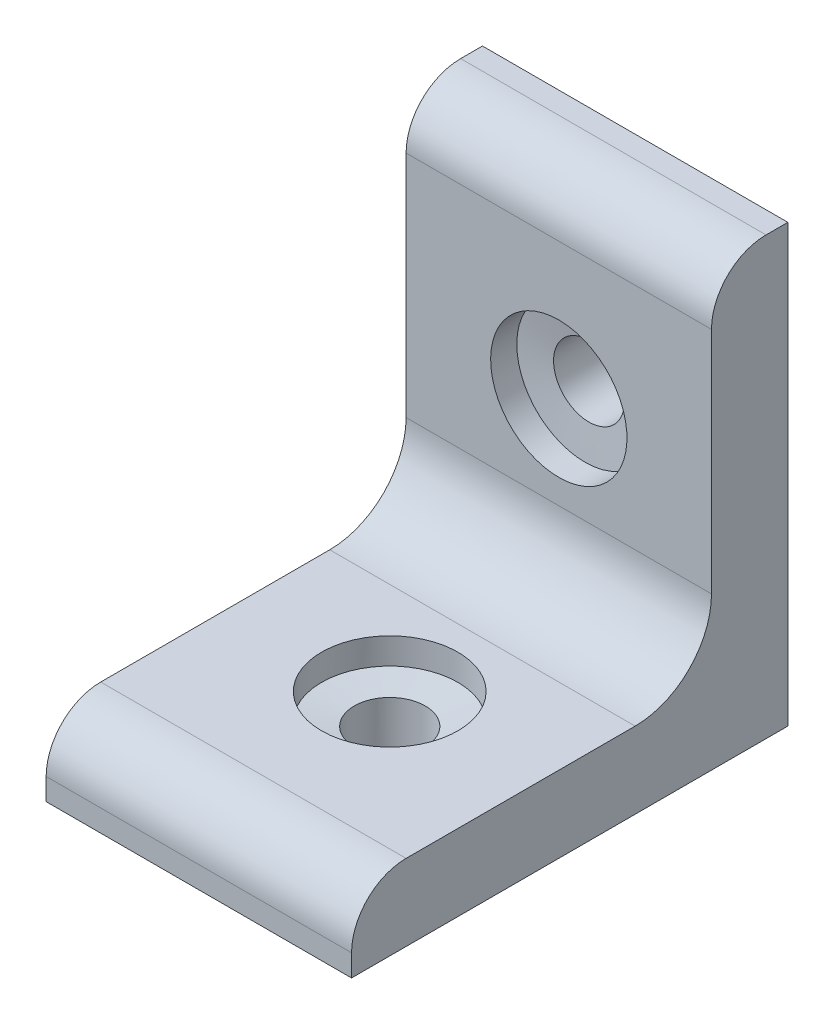
ISO-10303-21;
HEADER;
FILE_DESCRIPTION(('STEP AP214'),'2;1');
FILE_NAME('part.step','',(''),(''),'','','');
FILE_SCHEMA(('AUTOMOTIVE_DESIGN { 1 0 10303 214 1 1 1 1 }'));
ENDSEC;
DATA;
#1=APPLICATION_CONTEXT('core data for automotive mechanical design processes');
#2=APPLICATION_PROTOCOL_DEFINITION('international standard','automotive_design',2000,#1);
#3=PRODUCT_CONTEXT('',#1,'mechanical');
#4=PRODUCT('Part','Part','',(#3));
#5=PRODUCT_RELATED_PRODUCT_CATEGORY('part','',(#4));
#6=PRODUCT_DEFINITION_FORMATION('','',#4);
#7=PRODUCT_DEFINITION_CONTEXT('part definition',#1,'design');
#8=PRODUCT_DEFINITION('design','',#6,#7);
#9=PRODUCT_DEFINITION_SHAPE('','',#8);
#10=(LENGTH_UNIT() NAMED_UNIT(*) SI_UNIT(.MILLI.,.METRE.));
#11=(NAMED_UNIT(*) PLANE_ANGLE_UNIT() SI_UNIT($,.RADIAN.));
#12=(NAMED_UNIT(*) SI_UNIT($,.STERADIAN.) SOLID_ANGLE_UNIT());
#13=UNCERTAINTY_MEASURE_WITH_UNIT(LENGTH_MEASURE(1.E-05),#10,'distance_accuracy_value','');
#14=(GEOMETRIC_REPRESENTATION_CONTEXT(3) GLOBAL_UNCERTAINTY_ASSIGNED_CONTEXT((#13)) GLOBAL_UNIT_ASSIGNED_CONTEXT((#10,
#11,#12)) REPRESENTATION_CONTEXT('',''));
#15=CARTESIAN_POINT('',(0.,0.,0.));
#16=DIRECTION('',(0.,0.,1.));
#17=DIRECTION('',(1.,0.,0.));
#18=AXIS2_PLACEMENT_3D('',#15,#16,#17);
#19=CARTESIAN_POINT('',(14.,22.5,40.001));
#20=DIRECTION('',(0.,0.,-1.));
#21=DIRECTION('',(0.,1.,0.));
#22=AXIS2_PLACEMENT_3D('',#19,#20,#21);
#23=CYLINDRICAL_SURFACE('',#22,3.25);
#24=CARTESIAN_POINT('',(14.,22.5,4.23001195358669));
#25=DIRECTION('',(0.,0.,1.));
#26=DIRECTION('',(0.,-1.,0.));
#27=AXIS2_PLACEMENT_3D('',#24,#25,#26);
#28=CIRCLE('',#27,3.25);
#29=CARTESIAN_POINT('',(11.0555687792613,23.8757996897583,4.2300119535867));
#30=VERTEX_POINT('',#29);
#31=EDGE_CURVE('E262',#30,#30,#28,.F.);
#32=ORIENTED_EDGE('',*,*,#31,.F.);
#33=EDGE_LOOP('',(#32));
#34=FACE_BOUND('',#33,.T.);
#35=CARTESIAN_POINT('',(14.,22.5,0.));
#36=DIRECTION('',(0.,0.,1.));
#37=DIRECTION('',(0.,-1.,0.));
#38=AXIS2_PLACEMENT_3D('',#35,#36,#37);
#39=CIRCLE('',#38,3.25);
#40=CARTESIAN_POINT('',(14.,19.25,0.));
#41=VERTEX_POINT('',#40);
#42=EDGE_CURVE('E261',#41,#41,#39,.T.);
#43=ORIENTED_EDGE('',*,*,#42,.F.);
#44=EDGE_LOOP('',(#43));
#45=FACE_BOUND('',#44,.T.);
#46=ADVANCED_FACE('F16',(#34,#45),#23,.F.);
#47=CARTESIAN_POINT('',(14.,40.001,22.5));
#48=DIRECTION('',(0.,-1.,0.));
#49=DIRECTION('',(0.,0.,-1.));
#50=AXIS2_PLACEMENT_3D('',#47,#48,#49);
#51=CYLINDRICAL_SURFACE('',#50,3.25);
#52=CARTESIAN_POINT('',(14.,0.,22.5));
#53=DIRECTION('',(0.,-1.,0.));
#54=DIRECTION('',(0.,0.,-1.));
#55=AXIS2_PLACEMENT_3D('',#52,#53,#54);
#56=CIRCLE('',#55,3.25);
#57=CARTESIAN_POINT('',(14.,0.,19.25));
#58=VERTEX_POINT('',#57);
#59=EDGE_CURVE('E125',#58,#58,#56,.T.);
#60=ORIENTED_EDGE('',*,*,#59,.T.);
#61=EDGE_LOOP('',(#60));
#62=FACE_BOUND('',#61,.T.);
#63=CARTESIAN_POINT('',(14.,4.23001195358669,22.5));
#64=DIRECTION('',(0.,-1.,0.));
#65=DIRECTION('',(0.,0.,-1.));
#66=AXIS2_PLACEMENT_3D('',#63,#64,#65);
#67=CIRCLE('',#66,3.25);
#68=CARTESIAN_POINT('',(11.0555687792613,4.23001195358669,23.8757996897583));
#69=VERTEX_POINT('',#68);
#70=EDGE_CURVE('E236',#69,#69,#67,.F.);
#71=ORIENTED_EDGE('',*,*,#70,.T.);
#72=EDGE_LOOP('',(#71));
#73=FACE_BOUND('',#72,.T.);
#74=ADVANCED_FACE('F182',(#62,#73),#51,.F.);
#75=CARTESIAN_POINT('',(28.,7.,0.));
#76=DIRECTION('',(0.,-1.,0.));
#77=DIRECTION('',(0.,0.,-1.));
#78=AXIS2_PLACEMENT_3D('',#75,#76,#77);
#79=PLANE('',#78);
#80=CARTESIAN_POINT('',(14.,7.,22.5));
#81=DIRECTION('',(0.,1.,0.));
#82=DIRECTION('',(0.,0.,1.));
#83=AXIS2_PLACEMENT_3D('',#80,#81,#82);
#84=CIRCLE('',#83,6.25);
#85=CARTESIAN_POINT('',(14.,7.,28.75));
#86=VERTEX_POINT('',#85);
#87=EDGE_CURVE('E234',#86,#86,#84,.T.);
#88=ORIENTED_EDGE('',*,*,#87,.F.);
#89=EDGE_LOOP('',(#88));
#90=FACE_BOUND('',#89,.T.);
#91=DIRECTION('',(0.,0.,1.));
#92=VECTOR('',#91,1.);
#93=CARTESIAN_POINT('',(28.,7.,0.));
#94=LINE('',#93,#92);
#95=CARTESIAN_POINT('',(28.,7.,14.));
#96=VERTEX_POINT('',#95);
#97=CARTESIAN_POINT('',(28.,7.,35.));
#98=VERTEX_POINT('',#97);
#99=EDGE_CURVE('E110',#96,#98,#94,.T.);
#100=ORIENTED_EDGE('',*,*,#99,.F.);
#101=DIRECTION('',(-1.,0.,0.));
#102=VECTOR('',#101,1.);
#103=CARTESIAN_POINT('',(0.,7.,14.));
#104=LINE('',#103,#102);
#105=CARTESIAN_POINT('',(0.,7.,14.));
#106=VERTEX_POINT('',#105);
#107=EDGE_CURVE('E156',#96,#106,#104,.T.);
#108=ORIENTED_EDGE('',*,*,#107,.T.);
#109=DIRECTION('',(0.,0.,1.));
#110=VECTOR('',#109,1.);
#111=CARTESIAN_POINT('',(0.,7.,0.));
#112=LINE('',#111,#110);
#113=CARTESIAN_POINT('',(0.,7.,35.));
#114=VERTEX_POINT('',#113);
#115=EDGE_CURVE('E123',#106,#114,#112,.T.);
#116=ORIENTED_EDGE('',*,*,#115,.T.);
#117=DIRECTION('',(-1.,0.,0.));
#118=VECTOR('',#117,1.);
#119=CARTESIAN_POINT('',(28.,7.,35.));
#120=LINE('',#119,#118);
#121=EDGE_CURVE('E145',#114,#98,#120,.F.);
#122=ORIENTED_EDGE('',*,*,#121,.T.);
#123=EDGE_LOOP('',(#100,#108,#116,#122));
#124=FACE_BOUND('',#123,.T.);
#125=ADVANCED_FACE('F162',(#90,#124),#79,.F.);
#126=CARTESIAN_POINT('',(28.,0.,40.));
#127=DIRECTION('',(0.,0.,1.));
#128=DIRECTION('',(1.,0.,0.));
#129=AXIS2_PLACEMENT_3D('',#126,#127,#128);
#130=PLANE('',#129);
#131=DIRECTION('',(0.,1.,0.));
#132=VECTOR('',#131,1.);
#133=CARTESIAN_POINT('',(28.,0.,40.));
#134=LINE('',#133,#132);
#135=CARTESIAN_POINT('',(28.,0.,40.));
#136=VERTEX_POINT('',#135);
#137=CARTESIAN_POINT('',(28.,2.,40.));
#138=VERTEX_POINT('',#137);
#139=EDGE_CURVE('E91',#136,#138,#134,.T.);
#140=ORIENTED_EDGE('',*,*,#139,.T.);
#141=DIRECTION('',(-1.,0.,0.));
#142=VECTOR('',#141,1.);
#143=CARTESIAN_POINT('',(0.,2.,40.));
#144=LINE('',#143,#142);
#145=CARTESIAN_POINT('',(0.,2.,40.));
#146=VERTEX_POINT('',#145);
#147=EDGE_CURVE('E99',#138,#146,#144,.T.);
#148=ORIENTED_EDGE('',*,*,#147,.T.);
#149=DIRECTION('',(0.,1.,0.));
#150=VECTOR('',#149,1.);
#151=CARTESIAN_POINT('',(0.,0.,40.));
#152=LINE('',#151,#150);
#153=CARTESIAN_POINT('',(0.,0.,40.));
#154=VERTEX_POINT('',#153);
#155=EDGE_CURVE('E94',#154,#146,#152,.T.);
#156=ORIENTED_EDGE('',*,*,#155,.F.);
#157=DIRECTION('',(-1.,0.,0.));
#158=VECTOR('',#157,1.);
#159=CARTESIAN_POINT('',(28.,0.,40.));
#160=LINE('',#159,#158);
#161=EDGE_CURVE('E87',#136,#154,#160,.T.);
#162=ORIENTED_EDGE('',*,*,#161,.F.);
#163=EDGE_LOOP('',(#140,#148,#156,#162));
#164=FACE_BOUND('',#163,.T.);
#165=ADVANCED_FACE('F89',(#164),#130,.T.);
#166=CARTESIAN_POINT('',(28.,0.,0.));
#167=DIRECTION('',(0.,-1.,0.));
#168=DIRECTION('',(0.,0.,-1.));
#169=AXIS2_PLACEMENT_3D('',#166,#167,#168);
#170=PLANE('',#169);
#171=ORIENTED_EDGE('',*,*,#59,.F.);
#172=EDGE_LOOP('',(#171));
#173=FACE_BOUND('',#172,.T.);
#174=DIRECTION('',(0.,0.,1.));
#175=VECTOR('',#174,1.);
#176=CARTESIAN_POINT('',(0.,0.,0.));
#177=LINE('',#176,#175);
#178=CARTESIAN_POINT('',(0.,0.,0.));
#179=VERTEX_POINT('',#178);
#180=EDGE_CURVE('E127',#179,#154,#177,.T.);
#181=ORIENTED_EDGE('',*,*,#180,.F.);
#182=DIRECTION('',(-1.,0.,0.));
#183=VECTOR('',#182,1.);
#184=CARTESIAN_POINT('',(28.,0.,0.));
#185=LINE('',#184,#183);
#186=CARTESIAN_POINT('',(28.,0.,0.));
#187=VERTEX_POINT('',#186);
#188=EDGE_CURVE('E100',#187,#179,#185,.T.);
#189=ORIENTED_EDGE('',*,*,#188,.F.);
#190=DIRECTION('',(0.,0.,1.));
#191=VECTOR('',#190,1.);
#192=CARTESIAN_POINT('',(28.,0.,0.));
#193=LINE('',#192,#191);
#194=EDGE_CURVE('E106',#187,#136,#193,.T.);
#195=ORIENTED_EDGE('',*,*,#194,.T.);
#196=ORIENTED_EDGE('',*,*,#161,.T.);
#197=EDGE_LOOP('',(#181,#189,#195,#196));
#198=FACE_BOUND('',#197,.T.);
#199=ADVANCED_FACE('F112',(#173,#198),#170,.T.);
#200=CARTESIAN_POINT('',(28.,0.,0.));
#201=DIRECTION('',(0.,0.,-1.));
#202=DIRECTION('',(-1.,0.,0.));
#203=AXIS2_PLACEMENT_3D('',#200,#201,#202);
#204=PLANE('',#203);
#205=ORIENTED_EDGE('',*,*,#42,.T.);
#206=EDGE_LOOP('',(#205));
#207=FACE_BOUND('',#206,.T.);
#208=DIRECTION('',(0.,-1.,0.));
#209=VECTOR('',#208,1.);
#210=CARTESIAN_POINT('',(0.,0.,0.));
#211=LINE('',#210,#209);
#212=CARTESIAN_POINT('',(0.,40.,0.));
#213=VERTEX_POINT('',#212);
#214=EDGE_CURVE('E129',#213,#179,#211,.T.);
#215=ORIENTED_EDGE('',*,*,#214,.F.);
#216=DIRECTION('',(-1.,0.,0.));
#217=VECTOR('',#216,1.);
#218=CARTESIAN_POINT('',(28.,40.,0.));
#219=LINE('',#218,#217);
#220=CARTESIAN_POINT('',(28.,40.,0.));
#221=VERTEX_POINT('',#220);
#222=EDGE_CURVE('E122',#221,#213,#219,.T.);
#223=ORIENTED_EDGE('',*,*,#222,.F.);
#224=DIRECTION('',(0.,-1.,0.));
#225=VECTOR('',#224,1.);
#226=CARTESIAN_POINT('',(28.,0.,0.));
#227=LINE('',#226,#225);
#228=EDGE_CURVE('E113',#221,#187,#227,.T.);
#229=ORIENTED_EDGE('',*,*,#228,.T.);
#230=ORIENTED_EDGE('',*,*,#188,.T.);
#231=EDGE_LOOP('',(#215,#223,#229,#230));
#232=FACE_BOUND('',#231,.T.);
#233=ADVANCED_FACE('F219',(#207,#232),#204,.T.);
#234=CARTESIAN_POINT('',(28.,40.,7.));
#235=DIRECTION('',(0.,1.,0.));
#236=DIRECTION('',(0.,0.,1.));
#237=AXIS2_PLACEMENT_3D('',#234,#235,#236);
#238=PLANE('',#237);
#239=DIRECTION('',(0.,0.,-1.));
#240=VECTOR('',#239,1.);
#241=CARTESIAN_POINT('',(0.,40.,7.));
#242=LINE('',#241,#240);
#243=CARTESIAN_POINT('',(0.,40.,2.));
#244=VERTEX_POINT('',#243);
#245=EDGE_CURVE('E132',#244,#213,#242,.T.);
#246=ORIENTED_EDGE('',*,*,#245,.F.);
#247=DIRECTION('',(-1.,0.,0.));
#248=VECTOR('',#247,1.);
#249=CARTESIAN_POINT('',(28.,40.,2.));
#250=LINE('',#249,#248);
#251=CARTESIAN_POINT('',(28.,40.,2.));
#252=VERTEX_POINT('',#251);
#253=EDGE_CURVE('E154',#244,#252,#250,.F.);
#254=ORIENTED_EDGE('',*,*,#253,.T.);
#255=DIRECTION('',(0.,0.,-1.));
#256=VECTOR('',#255,1.);
#257=CARTESIAN_POINT('',(28.,40.,7.));
#258=LINE('',#257,#256);
#259=EDGE_CURVE('E115',#252,#221,#258,.T.);
#260=ORIENTED_EDGE('',*,*,#259,.T.);
#261=ORIENTED_EDGE('',*,*,#222,.T.);
#262=EDGE_LOOP('',(#246,#254,#260,#261));
#263=FACE_BOUND('',#262,.T.);
#264=ADVANCED_FACE('F215',(#263),#238,.T.);
#265=CARTESIAN_POINT('',(28.,0.,7.));
#266=DIRECTION('',(0.,0.,-1.));
#267=DIRECTION('',(-1.,0.,0.));
#268=AXIS2_PLACEMENT_3D('',#265,#266,#267);
#269=PLANE('',#268);
#270=CARTESIAN_POINT('',(14.,22.5,7.));
#271=DIRECTION('',(0.,0.,-1.));
#272=DIRECTION('',(0.,1.,0.));
#273=AXIS2_PLACEMENT_3D('',#270,#271,#272);
#274=CIRCLE('',#273,6.25);
#275=CARTESIAN_POINT('',(14.,28.75,7.));
#276=VERTEX_POINT('',#275);
#277=EDGE_CURVE('E260',#276,#276,#274,.T.);
#278=ORIENTED_EDGE('',*,*,#277,.T.);
#279=EDGE_LOOP('',(#278));
#280=FACE_BOUND('',#279,.T.);
#281=DIRECTION('',(0.,1.,0.));
#282=VECTOR('',#281,1.);
#283=CARTESIAN_POINT('',(0.,0.,7.));
#284=LINE('',#283,#282);
#285=CARTESIAN_POINT('',(0.,35.,7.));
#286=VERTEX_POINT('',#285);
#287=CARTESIAN_POINT('',(0.,14.,7.));
#288=VERTEX_POINT('',#287);
#289=EDGE_CURVE('E134',#286,#288,#284,.F.);
#290=ORIENTED_EDGE('',*,*,#289,.T.);
#291=DIRECTION('',(-1.,0.,0.));
#292=VECTOR('',#291,1.);
#293=CARTESIAN_POINT('',(28.,14.,7.));
#294=LINE('',#293,#292);
#295=CARTESIAN_POINT('',(28.,14.,7.));
#296=VERTEX_POINT('',#295);
#297=EDGE_CURVE('E37',#288,#296,#294,.F.);
#298=ORIENTED_EDGE('',*,*,#297,.T.);
#299=DIRECTION('',(0.,1.,0.));
#300=VECTOR('',#299,1.);
#301=CARTESIAN_POINT('',(28.,0.,7.));
#302=LINE('',#301,#300);
#303=CARTESIAN_POINT('',(28.,35.,7.));
#304=VERTEX_POINT('',#303);
#305=EDGE_CURVE('E120',#304,#296,#302,.F.);
#306=ORIENTED_EDGE('',*,*,#305,.F.);
#307=DIRECTION('',(-1.,0.,0.));
#308=VECTOR('',#307,1.);
#309=CARTESIAN_POINT('',(0.,35.,7.));
#310=LINE('',#309,#308);
#311=EDGE_CURVE('E151',#304,#286,#310,.T.);
#312=ORIENTED_EDGE('',*,*,#311,.T.);
#313=EDGE_LOOP('',(#290,#298,#306,#312));
#314=FACE_BOUND('',#313,.T.);
#315=ADVANCED_FACE('F211',(#280,#314),#269,.F.);
#316=CARTESIAN_POINT('',(28.,0.,0.));
#317=DIRECTION('',(-1.,0.,0.));
#318=DIRECTION('',(0.,0.,1.));
#319=AXIS2_PLACEMENT_3D('',#316,#317,#318);
#320=PLANE('',#319);
#321=ORIENTED_EDGE('',*,*,#305,.T.);
#322=CARTESIAN_POINT('',(28.,14.,14.));
#323=DIRECTION('',(-1.,0.,0.));
#324=DIRECTION('',(0.,0.,1.));
#325=AXIS2_PLACEMENT_3D('',#322,#323,#324);
#326=CIRCLE('',#325,7.);
#327=EDGE_CURVE('E10',#296,#96,#326,.T.);
#328=ORIENTED_EDGE('',*,*,#327,.T.);
#329=ORIENTED_EDGE('',*,*,#99,.T.);
#330=CARTESIAN_POINT('',(28.,2.,35.));
#331=DIRECTION('',(-1.,0.,0.));
#332=DIRECTION('',(0.,0.,1.));
#333=AXIS2_PLACEMENT_3D('',#330,#331,#332);
#334=CIRCLE('',#333,5.);
#335=EDGE_CURVE('E109',#98,#138,#334,.F.);
#336=ORIENTED_EDGE('',*,*,#335,.T.);
#337=ORIENTED_EDGE('',*,*,#139,.F.);
#338=ORIENTED_EDGE('',*,*,#194,.F.);
#339=ORIENTED_EDGE('',*,*,#228,.F.);
#340=ORIENTED_EDGE('',*,*,#259,.F.);
#341=CARTESIAN_POINT('',(28.,35.,2.));
#342=DIRECTION('',(-1.,0.,0.));
#343=DIRECTION('',(0.,0.,1.));
#344=AXIS2_PLACEMENT_3D('',#341,#342,#343);
#345=CIRCLE('',#344,5.);
#346=EDGE_CURVE('E148',#252,#304,#345,.F.);
#347=ORIENTED_EDGE('',*,*,#346,.T.);
#348=EDGE_LOOP('',(#321,#328,#329,#336,#337,#338,#339,#340,#347));
#349=FACE_BOUND('',#348,.T.);
#350=ADVANCED_FACE('F104',(#349),#320,.F.);
#351=CARTESIAN_POINT('',(0.,0.,0.));
#352=DIRECTION('',(-1.,0.,0.));
#353=DIRECTION('',(0.,0.,1.));
#354=AXIS2_PLACEMENT_3D('',#351,#352,#353);
#355=PLANE('',#354);
#356=ORIENTED_EDGE('',*,*,#155,.T.);
#357=CARTESIAN_POINT('',(0.,2.,35.));
#358=DIRECTION('',(-1.,0.,0.));
#359=DIRECTION('',(0.,0.,1.));
#360=AXIS2_PLACEMENT_3D('',#357,#358,#359);
#361=CIRCLE('',#360,5.);
#362=EDGE_CURVE('E142',#146,#114,#361,.T.);
#363=ORIENTED_EDGE('',*,*,#362,.T.);
#364=ORIENTED_EDGE('',*,*,#115,.F.);
#365=CARTESIAN_POINT('',(0.,14.,14.));
#366=DIRECTION('',(-1.,0.,0.));
#367=DIRECTION('',(0.,0.,1.));
#368=AXIS2_PLACEMENT_3D('',#365,#366,#367);
#369=CIRCLE('',#368,7.);
#370=EDGE_CURVE('E24',#106,#288,#369,.F.);
#371=ORIENTED_EDGE('',*,*,#370,.T.);
#372=ORIENTED_EDGE('',*,*,#289,.F.);
#373=CARTESIAN_POINT('',(0.,35.,2.));
#374=DIRECTION('',(-1.,0.,0.));
#375=DIRECTION('',(0.,0.,1.));
#376=AXIS2_PLACEMENT_3D('',#373,#374,#375);
#377=CIRCLE('',#376,5.);
#378=EDGE_CURVE('E140',#286,#244,#377,.T.);
#379=ORIENTED_EDGE('',*,*,#378,.T.);
#380=ORIENTED_EDGE('',*,*,#245,.T.);
#381=ORIENTED_EDGE('',*,*,#214,.T.);
#382=ORIENTED_EDGE('',*,*,#180,.T.);
#383=EDGE_LOOP('',(#356,#363,#364,#371,#372,#379,#380,#381,#382));
#384=FACE_BOUND('',#383,.T.);
#385=ADVANCED_FACE('F165',(#384),#355,.T.);
#386=CARTESIAN_POINT('',(28.,2.,35.));
#387=DIRECTION('',(1.,0.,0.));
#388=DIRECTION('',(0.,0.,-1.));
#389=AXIS2_PLACEMENT_3D('',#386,#387,#388);
#390=CYLINDRICAL_SURFACE('',#389,5.);
#391=ORIENTED_EDGE('',*,*,#335,.F.);
#392=ORIENTED_EDGE('',*,*,#121,.F.);
#393=ORIENTED_EDGE('',*,*,#362,.F.);
#394=ORIENTED_EDGE('',*,*,#147,.F.);
#395=EDGE_LOOP('',(#391,#392,#393,#394));
#396=FACE_BOUND('',#395,.T.);
#397=ADVANCED_FACE('F168',(#396),#390,.T.);
#398=CARTESIAN_POINT('',(28.,35.,2.));
#399=DIRECTION('',(1.,0.,0.));
#400=DIRECTION('',(0.,0.,-1.));
#401=AXIS2_PLACEMENT_3D('',#398,#399,#400);
#402=CYLINDRICAL_SURFACE('',#401,5.);
#403=ORIENTED_EDGE('',*,*,#346,.F.);
#404=ORIENTED_EDGE('',*,*,#253,.F.);
#405=ORIENTED_EDGE('',*,*,#378,.F.);
#406=ORIENTED_EDGE('',*,*,#311,.F.);
#407=EDGE_LOOP('',(#403,#404,#405,#406));
#408=FACE_BOUND('',#407,.T.);
#409=ADVANCED_FACE('F170',(#408),#402,.T.);
#410=CARTESIAN_POINT('',(14.,4.6,22.5));
#411=DIRECTION('',(0.,1.,0.));
#412=DIRECTION('',(0.,0.,1.));
#413=AXIS2_PLACEMENT_3D('',#410,#411,#412);
#414=CYLINDRICAL_SURFACE('',#413,6.25);
#415=CARTESIAN_POINT('',(14.,4.6,22.5));
#416=DIRECTION('',(0.,1.,0.));
#417=DIRECTION('',(0.,0.,1.));
#418=AXIS2_PLACEMENT_3D('',#415,#416,#417);
#419=CIRCLE('',#418,6.25);
#420=CARTESIAN_POINT('',(7.97153486855651,4.6,24.1492750404253));
#421=VERTEX_POINT('',#420);
#422=EDGE_CURVE('E241',#421,#421,#419,.T.);
#423=ORIENTED_EDGE('',*,*,#422,.F.);
#424=EDGE_LOOP('',(#423));
#425=FACE_BOUND('',#424,.T.);
#426=ORIENTED_EDGE('',*,*,#87,.T.);
#427=EDGE_LOOP('',(#426));
#428=FACE_BOUND('',#427,.T.);
#429=ADVANCED_FACE('F177',(#425,#428),#414,.F.);
#430=CARTESIAN_POINT('',(7.97153486855651,4.6,24.1492750404253));
#431=CARTESIAN_POINT('',(17.140580557091,3.5,23.3362139465604));
#432=CARTESIAN_POINT('',(4.67298478770585,4.6,12.0923447775383));
#433=CARTESIAN_POINT('',(15.4681526639701,3.5,29.6173750607424));
#434=CARTESIAN_POINT('',(16.7299150505928,4.6,8.79379469668768));
#435=CARTESIAN_POINT('',(9.18699154978817,3.5,27.9449471676215));
#436=CARTESIAN_POINT('',(20.0284651314435,4.6,20.8507249595747));
#437=CARTESIAN_POINT('',(10.859419442909,3.5,21.6637860534396));
#438=CARTESIAN_POINT('',(23.3270152122941,4.6,32.9076552224617));
#439=CARTESIAN_POINT('',(12.5318473360299,3.5,15.3826249392576));
#440=CARTESIAN_POINT('',(11.2700849494072,4.6,36.2062053033123));
#441=CARTESIAN_POINT('',(18.8130084502118,3.5,17.0550528323785));
#442=CARTESIAN_POINT('',(7.97153486855651,4.6,24.1492750404253));
#443=CARTESIAN_POINT('',(17.140580557091,3.5,23.3362139465604));
#444=(BOUNDED_SURFACE() B_SPLINE_SURFACE(3,1,((#430,#431),(#432,#433),(#434,#435),(#436,#437),
(#438,#439),(#440,#441),(#442,#443)),.UNSPECIFIED.,.T.,.F.,.F.) B_SPLINE_SURFACE_WITH_KNOTS((4,
3,4),(2,2),(0.,0.5,1.),(0.,1.),
.UNSPECIFIED.) GEOMETRIC_REPRESENTATION_ITEM() RATIONAL_B_SPLINE_SURFACE(((1.,1.),
(0.333333333333333,0.333333333333333),(0.333333333333333,0.333333333333333),(1.,1.),
(0.333333333333333,0.333333333333333),(0.333333333333333,0.333333333333333),(1.,1.))) REPRESENTATION_ITEM('') SURFACE());
#445=CARTESIAN_POINT('',(7.97153486855651,4.6,24.1492750404253));
#446=CARTESIAN_POINT('',(8.00366022179301,4.59614595784986,24.1464263388559));
#447=CARTESIAN_POINT('',(8.03578557502952,4.59229191569972,24.1435776372864));
#448=CARTESIAN_POINT('',(8.10003628150254,4.58458383139944,24.1378802341475));
#449=CARTESIAN_POINT('',(8.13216163473905,4.5807297892493,24.1350315325781));
#450=CARTESIAN_POINT('',(8.19641234121206,4.57302170494903,24.1293341294392));
#451=CARTESIAN_POINT('',(8.22853769444857,4.56916766279889,24.1264854278697));
#452=CARTESIAN_POINT('',(8.29278840092159,4.56145957849861,24.1207880247308));
#453=CARTESIAN_POINT('',(8.32491375415809,4.55760553634847,24.1179393231614));
#454=CARTESIAN_POINT('',(8.38916446063111,4.5498974520482,24.1122419200225));
#455=CARTESIAN_POINT('',(8.42128981386762,4.54604340989806,24.109393218453));
#456=CARTESIAN_POINT('',(8.48554052034063,4.53833532559778,24.1036958153141));
#457=CARTESIAN_POINT('',(8.51766587357714,4.53448128344764,24.1008471137447));
#458=CARTESIAN_POINT('',(8.58191658005016,4.52677319914736,24.0951497106058));
#459=CARTESIAN_POINT('',(8.61404193328666,4.52291915699723,24.0923010090364));
#460=CARTESIAN_POINT('',(8.67829263975968,4.51521107269695,24.0866036058975));
#461=CARTESIAN_POINT('',(8.71041799299619,4.51135703054681,24.083754904328));
#462=CARTESIAN_POINT('',(8.77466869946921,4.50364894624653,24.0780575011891));
#463=CARTESIAN_POINT('',(8.80679405270571,4.49979490409639,24.0752087996197));
#464=CARTESIAN_POINT('',(8.87104475917873,4.49208681979612,24.0695113964808));
#465=CARTESIAN_POINT('',(8.90317011241524,4.48823277764598,24.0666626949113));
#466=CARTESIAN_POINT('',(8.96742081888825,4.4805246933457,24.0609652917724));
#467=CARTESIAN_POINT('',(8.99954617212476,4.47667065119556,24.058116590203));
#468=CARTESIAN_POINT('',(9.06379687859778,4.46896256689528,24.0524191870641));
#469=CARTESIAN_POINT('',(9.09592223183428,4.46510852474515,24.0495704854946));
#470=CARTESIAN_POINT('',(9.1601729383073,4.45740044044487,24.0438730823557));
#471=CARTESIAN_POINT('',(9.19229829154381,4.45354639829473,24.0410243807863));
#472=CARTESIAN_POINT('',(9.25654899801682,4.44583831399445,24.0353269776474));
#473=CARTESIAN_POINT('',(9.28867435125333,4.44198427184431,24.0324782760779));
#474=CARTESIAN_POINT('',(9.35292505772635,4.43427618754404,24.026780872939));
#475=CARTESIAN_POINT('',(9.38505041096286,4.4304221453939,24.0239321713696));
#476=CARTESIAN_POINT('',(9.44930111743587,4.42271406109362,24.0182347682307));
#477=CARTESIAN_POINT('',(9.48142647067238,4.41886001894348,24.0153860666613));
#478=CARTESIAN_POINT('',(9.5456771771454,4.4111519346432,24.0096886635224));
#479=CARTESIAN_POINT('',(9.5778025303819,4.40729789249307,24.0068399619529));
#480=CARTESIAN_POINT('',(9.64205323685492,4.39958980819279,24.001142558814));
#481=CARTESIAN_POINT('',(9.67417859009143,4.39573576604265,23.9982938572446));
#482=CARTESIAN_POINT('',(9.73842929656444,4.38802768174237,23.9925964541057));
#483=CARTESIAN_POINT('',(9.77055464980095,4.38417363959223,23.9897477525362));
#484=CARTESIAN_POINT('',(9.83480535627397,4.37646555529196,23.9840503493973));
#485=CARTESIAN_POINT('',(9.86693070951048,4.37261151314182,23.9812016478279));
#486=CARTESIAN_POINT('',(9.93118141598349,4.36490342884154,23.975504244689));
#487=CARTESIAN_POINT('',(9.96330676922,4.3610493866914,23.9726555431195));
#488=CARTESIAN_POINT('',(10.027557475693,4.35334130239112,23.9669581399806));
#489=CARTESIAN_POINT('',(10.0596828289295,4.34948726024099,23.9641094384112));
#490=CARTESIAN_POINT('',(10.1239335354025,4.34177917594071,23.9584120352723));
#491=CARTESIAN_POINT('',(10.156058888639,4.33792513379057,23.9555633337028));
#492=CARTESIAN_POINT('',(10.2203095951121,4.33021704949029,23.9498659305639));
#493=CARTESIAN_POINT('',(10.2524349483486,4.32636300734015,23.9470172289945));
#494=CARTESIAN_POINT('',(10.3166856548216,4.31865492303988,23.9413198258556));
#495=CARTESIAN_POINT('',(10.3488110080581,4.31480088088974,23.9384711242861));
#496=CARTESIAN_POINT('',(10.4130617145311,4.30709279658946,23.9327737211472));
#497=CARTESIAN_POINT('',(10.4451870677676,4.30323875443932,23.9299250195778));
#498=CARTESIAN_POINT('',(10.5094377742406,4.29553067013905,23.9242276164389));
#499=CARTESIAN_POINT('',(10.5415631274771,4.29167662798891,23.9213789148695));
#500=CARTESIAN_POINT('',(10.6058138339502,4.28396854368863,23.9156815117306));
#501=CARTESIAN_POINT('',(10.6379391871867,4.28011450153849,23.9128328101611));
#502=CARTESIAN_POINT('',(10.7021898936597,4.27240641723821,23.9071354070222));
#503=CARTESIAN_POINT('',(10.7343152468962,4.26855237508807,23.9042867054528));
#504=CARTESIAN_POINT('',(10.7985659533692,4.2608442907878,23.8985893023139));
#505=CARTESIAN_POINT('',(10.8306913066057,4.25699024863766,23.8957406007444));
#506=CARTESIAN_POINT('',(10.8949420130787,4.24928216433738,23.8900431976055));
#507=CARTESIAN_POINT('',(10.9270673663152,4.24542812218724,23.8871944960361));
#508=CARTESIAN_POINT('',(10.9913180727883,4.23772003788697,23.8814970928972));
#509=CARTESIAN_POINT('',(11.0234434260248,4.23386599573683,23.8786483913277));
#510=CARTESIAN_POINT('',(11.0555687792613,4.23001195358669,23.8757996897583));
#511=B_SPLINE_CURVE_WITH_KNOTS('',3,(#445,#446,#447,#448,#449,#450,#451,#452,#453,#454,#455,
#456,#457,#458,#459,#460,#461,#462,#463,#464,#465,#466,#467,#468,#469,#470,#471,#472,#473,#474,
#475,#476,#477,#478,#479,#480,#481,#482,#483,#484,#485,#486,#487,#488,#489,#490,#491,#492,#493,
#494,#495,#496,#497,#498,#499,#500,#501,#502,#503,#504,#505,#506,#507,#508,#509,#510),
.UNSPECIFIED.,.F.,.F.,(4,2,2,2,2,2,2,2,2,2,2,2,2,2,2,2,2,2,2,2,2,2,2,2,2,2,2,2,2,2,2,2,4),(0.,
0.0974426167489111,0.194885233497822,0.292327850246733,0.389770466995643,0.487213083744554,
0.584655700493465,0.682098317242376,0.779540933991288,0.876983550740199,0.974426167489108,
1.07186878423802,1.16931140098693,1.26675401773584,1.36419663448475,1.46163925123366,
1.55908186798257,1.65652448473148,1.7539671014804,1.85140971822931,1.94885233497822,
2.04629495172713,2.14373756847604,2.24118018522495,2.33862280197386,2.43606541872277,
2.53350803547168,2.63095065222059,2.7283932689695,2.82583588571842,2.92327850246733,
3.02072111921624,3.11816373596515),.UNSPECIFIED.);
#512=EDGE_CURVE('',#421,#69,#511,.T.);
#513=ORIENTED_EDGE('',*,*,#422,.T.);
#514=ORIENTED_EDGE('',*,*,#70,.F.);
#515=ORIENTED_EDGE('',*,*,#512,.T.);
#516=ORIENTED_EDGE('',*,*,#512,.F.);
#517=EDGE_LOOP('',(#513,#515,#514,#516));
#518=FACE_BOUND('',#517,.T.);
#519=ADVANCED_FACE('F196',(#518),#444,.F.);
#520=CARTESIAN_POINT('',(28.,14.,14.));
#521=DIRECTION('',(1.,0.,0.));
#522=DIRECTION('',(0.,0.,-1.));
#523=AXIS2_PLACEMENT_3D('',#520,#521,#522);
#524=CYLINDRICAL_SURFACE('',#523,7.);
#525=ORIENTED_EDGE('',*,*,#327,.F.);
#526=ORIENTED_EDGE('',*,*,#297,.F.);
#527=ORIENTED_EDGE('',*,*,#370,.F.);
#528=ORIENTED_EDGE('',*,*,#107,.F.);
#529=EDGE_LOOP('',(#525,#526,#527,#528));
#530=FACE_BOUND('',#529,.T.);
#531=ADVANCED_FACE('F18',(#530),#524,.F.);
#532=CARTESIAN_POINT('',(14.,22.5,4.6));
#533=DIRECTION('',(0.,0.,1.));
#534=DIRECTION('',(0.,-1.,0.));
#535=AXIS2_PLACEMENT_3D('',#532,#533,#534);
#536=CYLINDRICAL_SURFACE('',#535,6.25);
#537=CARTESIAN_POINT('',(14.,22.5,4.6));
#538=DIRECTION('',(0.,0.,-1.));
#539=DIRECTION('',(0.,1.,0.));
#540=AXIS2_PLACEMENT_3D('',#537,#538,#539);
#541=CIRCLE('',#540,6.25);
#542=CARTESIAN_POINT('',(7.97153486855651,24.1492750404253,4.6));
#543=VERTEX_POINT('',#542);
#544=EDGE_CURVE('E257',#543,#543,#541,.T.);
#545=ORIENTED_EDGE('',*,*,#544,.T.);
#546=EDGE_LOOP('',(#545));
#547=FACE_BOUND('',#546,.T.);
#548=ORIENTED_EDGE('',*,*,#277,.F.);
#549=EDGE_LOOP('',(#548));
#550=FACE_BOUND('',#549,.T.);
#551=ADVANCED_FACE('F194',(#547,#550),#536,.F.);
#552=CARTESIAN_POINT('',(7.97153486855651,24.1492750404253,4.6));
#553=CARTESIAN_POINT('',(17.140580557091,23.3362139465604,3.5));
#554=CARTESIAN_POINT('',(4.67298478770585,12.0923447775383,4.6));
#555=CARTESIAN_POINT('',(15.4681526639701,29.6173750607424,3.5));
#556=CARTESIAN_POINT('',(16.7299150505928,8.79379469668768,4.6));
#557=CARTESIAN_POINT('',(9.18699154978817,27.9449471676215,3.5));
#558=CARTESIAN_POINT('',(20.0284651314435,20.8507249595747,4.6));
#559=CARTESIAN_POINT('',(10.859419442909,21.6637860534396,3.5));
#560=CARTESIAN_POINT('',(23.3270152122941,32.9076552224617,4.6));
#561=CARTESIAN_POINT('',(12.5318473360299,15.3826249392576,3.5));
#562=CARTESIAN_POINT('',(11.2700849494072,36.2062053033123,4.6));
#563=CARTESIAN_POINT('',(18.8130084502118,17.0550528323785,3.5));
#564=CARTESIAN_POINT('',(7.97153486855651,24.1492750404253,4.6));
#565=CARTESIAN_POINT('',(17.140580557091,23.3362139465604,3.5));
#566=(BOUNDED_SURFACE() B_SPLINE_SURFACE(3,1,((#552,#553),(#554,#555),(#556,#557),(#558,#559),
(#560,#561),(#562,#563),(#564,#565)),.UNSPECIFIED.,.T.,.F.,.F.) B_SPLINE_SURFACE_WITH_KNOTS((4,
3,4),(2,2),(0.,0.5,1.),(0.,1.),
.UNSPECIFIED.) GEOMETRIC_REPRESENTATION_ITEM() RATIONAL_B_SPLINE_SURFACE(((1.,1.),
(0.333333333333333,0.333333333333333),(0.333333333333333,0.333333333333333),(1.,1.),
(0.333333333333333,0.333333333333333),(0.333333333333333,0.333333333333333),(1.,1.))) REPRESENTATION_ITEM('') SURFACE());
#567=CARTESIAN_POINT('',(11.0555687792613,23.8757996897583,4.2300119535867));
#568=CARTESIAN_POINT('',(11.0234434260248,23.8786483913277,4.23386599573683));
#569=CARTESIAN_POINT('',(10.9913180727882,23.8814970928972,4.23772003788697));
#570=CARTESIAN_POINT('',(10.9270673663152,23.8871944960361,4.24542812218725));
#571=CARTESIAN_POINT('',(10.8949420130787,23.8900431976055,4.24928216433739));
#572=CARTESIAN_POINT('',(10.8306913066057,23.8957406007444,4.25699024863767));
#573=CARTESIAN_POINT('',(10.7985659533692,23.8985893023139,4.26084429078781));
#574=CARTESIAN_POINT('',(10.7343152468962,23.9042867054528,4.26855237508808));
#575=CARTESIAN_POINT('',(10.7021898936597,23.9071354070222,4.27240641723822));
#576=CARTESIAN_POINT('',(10.6379391871867,23.9128328101611,4.2801145015385));
#577=CARTESIAN_POINT('',(10.6058138339502,23.9156815117306,4.28396854368864));
#578=CARTESIAN_POINT('',(10.5415631274771,23.9213789148695,4.29167662798891));
#579=CARTESIAN_POINT('',(10.5094377742406,23.9242276164389,4.29553067013905));
#580=CARTESIAN_POINT('',(10.4451870677676,23.9299250195778,4.30323875443933));
#581=CARTESIAN_POINT('',(10.4130617145311,23.9327737211472,4.30709279658947));
#582=CARTESIAN_POINT('',(10.3488110080581,23.9384711242861,4.31480088088975));
#583=CARTESIAN_POINT('',(10.3166856548216,23.9413198258556,4.31865492303988));
#584=CARTESIAN_POINT('',(10.2524349483486,23.9470172289945,4.32636300734016));
#585=CARTESIAN_POINT('',(10.2203095951121,23.9498659305639,4.3302170494903));
#586=CARTESIAN_POINT('',(10.156058888639,23.9555633337028,4.33792513379058));
#587=CARTESIAN_POINT('',(10.1239335354025,23.9584120352723,4.34177917594072));
#588=CARTESIAN_POINT('',(10.0596828289295,23.9641094384112,4.34948726024099));
#589=CARTESIAN_POINT('',(10.027557475693,23.9669581399806,4.35334130239113));
#590=CARTESIAN_POINT('',(9.96330676921999,23.9726555431195,4.36104938669141));
#591=CARTESIAN_POINT('',(9.93118141598349,23.975504244689,4.36490342884155));
#592=CARTESIAN_POINT('',(9.86693070951047,23.9812016478279,4.37261151314182));
#593=CARTESIAN_POINT('',(9.83480535627396,23.9840503493973,4.37646555529196));
#594=CARTESIAN_POINT('',(9.77055464980094,23.9897477525362,4.38417363959224));
#595=CARTESIAN_POINT('',(9.73842929656444,23.9925964541057,4.38802768174238));
#596=CARTESIAN_POINT('',(9.67417859009142,23.9982938572446,4.39573576604266));
#597=CARTESIAN_POINT('',(9.64205323685491,24.001142558814,4.39958980819279));
#598=CARTESIAN_POINT('',(9.5778025303819,24.0068399619529,4.40729789249307));
#599=CARTESIAN_POINT('',(9.54567717714539,24.0096886635224,4.41115193464321));
#600=CARTESIAN_POINT('',(9.48142647067237,24.0153860666613,4.41886001894349));
#601=CARTESIAN_POINT('',(9.44930111743587,24.0182347682307,4.42271406109363));
#602=CARTESIAN_POINT('',(9.38505041096285,24.0239321713696,4.4304221453939));
#603=CARTESIAN_POINT('',(9.35292505772634,24.026780872939,4.43427618754404));
#604=CARTESIAN_POINT('',(9.28867435125333,24.0324782760779,4.44198427184432));
#605=CARTESIAN_POINT('',(9.25654899801682,24.0353269776474,4.44583831399446));
#606=CARTESIAN_POINT('',(9.19229829154381,24.0410243807863,4.45354639829474));
#607=CARTESIAN_POINT('',(9.1601729383073,24.0438730823557,4.45740044044487));
#608=CARTESIAN_POINT('',(9.09592223183428,24.0495704854946,4.46510852474515));
#609=CARTESIAN_POINT('',(9.06379687859777,24.0524191870641,4.46896256689529));
#610=CARTESIAN_POINT('',(8.99954617212476,24.058116590203,4.47667065119557));
#611=CARTESIAN_POINT('',(8.96742081888825,24.0609652917724,4.48052469334571));
#612=CARTESIAN_POINT('',(8.90317011241523,24.0666626949113,4.48823277764598));
#613=CARTESIAN_POINT('',(8.87104475917872,24.0695113964808,4.49208681979612));
#614=CARTESIAN_POINT('',(8.80679405270571,24.0752087996197,4.4997949040964));
#615=CARTESIAN_POINT('',(8.7746686994692,24.0780575011891,4.50364894624654));
#616=CARTESIAN_POINT('',(8.71041799299618,24.083754904328,4.51135703054682));
#617=CARTESIAN_POINT('',(8.67829263975968,24.0866036058975,4.51521107269695));
#618=CARTESIAN_POINT('',(8.61404193328666,24.0923010090364,4.52291915699723));
#619=CARTESIAN_POINT('',(8.58191658005015,24.0951497106058,4.52677319914737));
#620=CARTESIAN_POINT('',(8.51766587357714,24.1008471137447,4.53448128344765));
#621=CARTESIAN_POINT('',(8.48554052034063,24.1036958153141,4.53833532559779));
#622=CARTESIAN_POINT('',(8.42128981386762,24.109393218453,4.54604340989806));
#623=CARTESIAN_POINT('',(8.38916446063111,24.1122419200225,4.5498974520482));
#624=CARTESIAN_POINT('',(8.32491375415809,24.1179393231614,4.55760553634848));
#625=CARTESIAN_POINT('',(8.29278840092159,24.1207880247308,4.56145957849862));
#626=CARTESIAN_POINT('',(8.22853769444857,24.1264854278697,4.56916766279889));
#627=CARTESIAN_POINT('',(8.19641234121206,24.1293341294392,4.57302170494903));
#628=CARTESIAN_POINT('',(8.13216163473905,24.1350315325781,4.58072978924931));
#629=CARTESIAN_POINT('',(8.10003628150254,24.1378802341475,4.58458383139945));
#630=CARTESIAN_POINT('',(8.03578557502952,24.1435776372864,4.59229191569973));
#631=CARTESIAN_POINT('',(8.00366022179301,24.1464263388559,4.59614595784987));
#632=CARTESIAN_POINT('',(7.97153486855651,24.1492750404253,4.6));
#633=B_SPLINE_CURVE_WITH_KNOTS('',3,(#567,#568,#569,#570,#571,#572,#573,#574,#575,#576,#577,
#578,#579,#580,#581,#582,#583,#584,#585,#586,#587,#588,#589,#590,#591,#592,#593,#594,#595,#596,
#597,#598,#599,#600,#601,#602,#603,#604,#605,#606,#607,#608,#609,#610,#611,#612,#613,#614,#615,
#616,#617,#618,#619,#620,#621,#622,#623,#624,#625,#626,#627,#628,#629,#630,#631,#632),
.UNSPECIFIED.,.F.,.F.,(4,2,2,2,2,2,2,2,2,2,2,2,2,2,2,2,2,2,2,2,2,2,2,2,2,2,2,2,2,2,2,2,4),(0.,
0.0974426167489111,0.194885233497823,0.292327850246734,0.389770466995643,0.487213083744554,
0.584655700493464,0.682098317242375,0.779540933991286,0.876983550740197,0.974426167489107,
1.07186878423802,1.16931140098693,1.26675401773584,1.36419663448475,1.46163925123366,
1.55908186798257,1.65652448473148,1.75396710148039,1.8514097182293,1.94885233497821,
2.04629495172712,2.14373756847603,2.24118018522494,2.33862280197385,2.43606541872277,
2.53350803547167,2.63095065222059,2.7283932689695,2.82583588571841,2.92327850246732,
3.02072111921623,3.11816373596514),.UNSPECIFIED.);
#634=EDGE_CURVE('',#30,#543,#633,.T.);
#635=ORIENTED_EDGE('',*,*,#31,.T.);
#636=ORIENTED_EDGE('',*,*,#544,.F.);
#637=ORIENTED_EDGE('',*,*,#634,.T.);
#638=ORIENTED_EDGE('',*,*,#634,.F.);
#639=EDGE_LOOP('',(#635,#637,#636,#638));
#640=FACE_BOUND('',#639,.T.);
#641=ADVANCED_FACE('F248',(#640),#566,.T.);
#642=CLOSED_SHELL('',(#46,#74,#125,#165,#199,#233,#264,#315,#350,#385,#397,#409,#429,#519,#531,
#551,#641));
#643=MANIFOLD_SOLID_BREP('B1',#642);
#644=ADVANCED_BREP_SHAPE_REPRESENTATION('',(#18,#643),#14);
#645=SHAPE_DEFINITION_REPRESENTATION(#9,#644);
ENDSEC;
END-ISO-10303-21;
